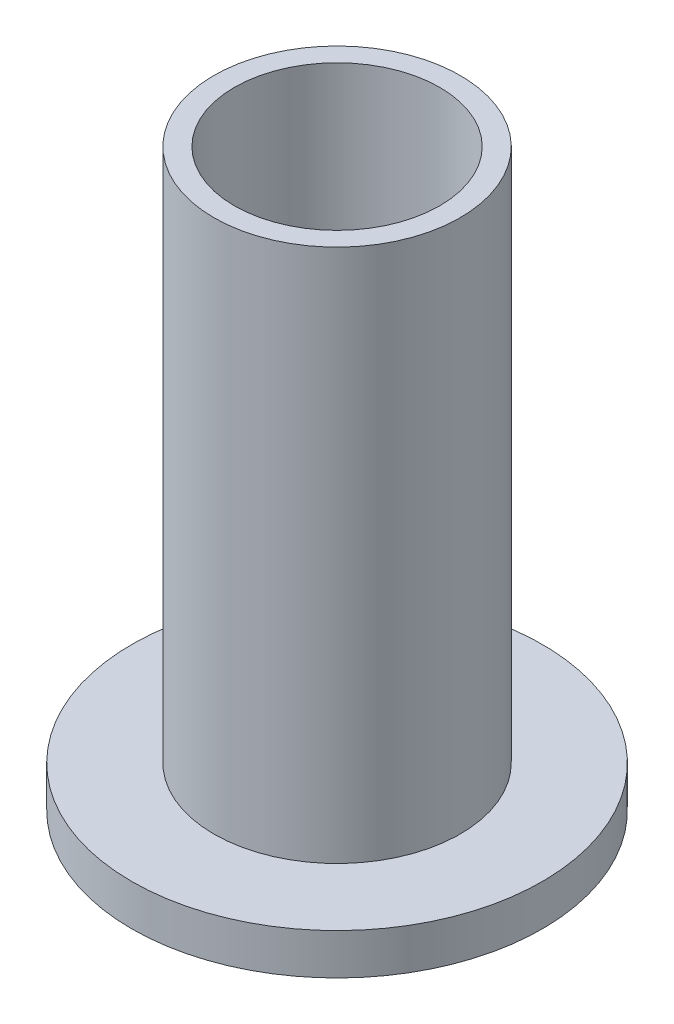
ISO-10303-21;
HEADER;
FILE_DESCRIPTION(('STEP AP214'),'2;1');
FILE_NAME('part.step','',(''),(''),'','','');
FILE_SCHEMA(('AUTOMOTIVE_DESIGN { 1 0 10303 214 1 1 1 1 }'));
ENDSEC;
DATA;
#1=APPLICATION_CONTEXT('core data for automotive mechanical design processes');
#2=APPLICATION_PROTOCOL_DEFINITION('international standard','automotive_design',2000,#1);
#3=PRODUCT_CONTEXT('',#1,'mechanical');
#4=PRODUCT('Part','Part','',(#3));
#5=PRODUCT_RELATED_PRODUCT_CATEGORY('part','',(#4));
#6=PRODUCT_DEFINITION_FORMATION('','',#4);
#7=PRODUCT_DEFINITION_CONTEXT('part definition',#1,'design');
#8=PRODUCT_DEFINITION('design','',#6,#7);
#9=PRODUCT_DEFINITION_SHAPE('','',#8);
#10=(LENGTH_UNIT() NAMED_UNIT(*) SI_UNIT(.MILLI.,.METRE.));
#11=(NAMED_UNIT(*) PLANE_ANGLE_UNIT() SI_UNIT($,.RADIAN.));
#12=(NAMED_UNIT(*) SI_UNIT($,.STERADIAN.) SOLID_ANGLE_UNIT());
#13=UNCERTAINTY_MEASURE_WITH_UNIT(LENGTH_MEASURE(1.E-05),#10,'distance_accuracy_value','');
#14=(GEOMETRIC_REPRESENTATION_CONTEXT(3) GLOBAL_UNCERTAINTY_ASSIGNED_CONTEXT((#13)) GLOBAL_UNIT_ASSIGNED_CONTEXT((#10,
#11,#12)) REPRESENTATION_CONTEXT('',''));
#15=CARTESIAN_POINT('',(0.,0.,0.));
#16=DIRECTION('',(0.,0.,1.));
#17=DIRECTION('',(1.,0.,0.));
#18=AXIS2_PLACEMENT_3D('',#15,#16,#17);
#19=CARTESIAN_POINT('',(-6.,17.1455696202532,0.));
#20=DIRECTION('',(0.,1.,0.));
#21=DIRECTION('',(0.,0.,1.));
#22=AXIS2_PLACEMENT_3D('',#19,#20,#21);
#23=PLANE('',#22);
#24=CARTESIAN_POINT('',(0.,17.1455696202532,0.));
#25=DIRECTION('',(0.,1.,0.));
#26=DIRECTION('',(0.,0.,1.));
#27=AXIS2_PLACEMENT_3D('',#24,#25,#26);
#28=CIRCLE('',#27,6.);
#29=CARTESIAN_POINT('',(0.,17.1455696202532,6.));
#30=VERTEX_POINT('',#29);
#31=EDGE_CURVE('E52',#30,#30,#28,.T.);
#32=ORIENTED_EDGE('',*,*,#31,.T.);
#33=EDGE_LOOP('',(#32));
#34=FACE_BOUND('',#33,.T.);
#35=CARTESIAN_POINT('',(0.,17.1455696202532,0.));
#36=DIRECTION('',(0.,1.,0.));
#37=DIRECTION('',(0.,0.,1.));
#38=AXIS2_PLACEMENT_3D('',#35,#36,#37);
#39=CIRCLE('',#38,5.);
#40=CARTESIAN_POINT('',(0.,17.1455696202532,5.));
#41=VERTEX_POINT('',#40);
#42=EDGE_CURVE('E10',#41,#41,#39,.T.);
#43=ORIENTED_EDGE('',*,*,#42,.F.);
#44=EDGE_LOOP('',(#43));
#45=FACE_BOUND('',#44,.T.);
#46=ADVANCED_FACE('F30',(#34,#45),#23,.T.);
#47=CARTESIAN_POINT('',(0.,15.2848101265823,0.));
#48=DIRECTION('',(0.,1.,0.));
#49=DIRECTION('',(0.,0.,1.));
#50=AXIS2_PLACEMENT_3D('',#47,#48,#49);
#51=CYLINDRICAL_SURFACE('',#50,5.);
#52=ORIENTED_EDGE('',*,*,#42,.T.);
#53=EDGE_LOOP('',(#52));
#54=FACE_BOUND('',#53,.T.);
#55=CARTESIAN_POINT('',(0.,-10.8544303797468,0.));
#56=DIRECTION('',(0.,1.,0.));
#57=DIRECTION('',(0.,0.,1.));
#58=AXIS2_PLACEMENT_3D('',#55,#56,#57);
#59=CIRCLE('',#58,5.);
#60=CARTESIAN_POINT('',(0.,-10.8544303797468,5.));
#61=VERTEX_POINT('',#60);
#62=EDGE_CURVE('E36',#61,#61,#59,.T.);
#63=ORIENTED_EDGE('',*,*,#62,.F.);
#64=EDGE_LOOP('',(#63));
#65=FACE_BOUND('',#64,.T.);
#66=ADVANCED_FACE('F70',(#54,#65),#51,.F.);
#67=CARTESIAN_POINT('',(-5.,-10.8544303797468,0.));
#68=DIRECTION('',(0.,-1.,0.));
#69=DIRECTION('',(0.,0.,-1.));
#70=AXIS2_PLACEMENT_3D('',#67,#68,#69);
#71=PLANE('',#70);
#72=ORIENTED_EDGE('',*,*,#62,.T.);
#73=EDGE_LOOP('',(#72));
#74=FACE_BOUND('',#73,.T.);
#75=CARTESIAN_POINT('',(0.,-10.8544303797468,0.));
#76=DIRECTION('',(0.,1.,0.));
#77=DIRECTION('',(0.,0.,1.));
#78=AXIS2_PLACEMENT_3D('',#75,#76,#77);
#79=CIRCLE('',#78,10.);
#80=CARTESIAN_POINT('',(0.,-10.8544303797468,10.));
#81=VERTEX_POINT('',#80);
#82=EDGE_CURVE('E40',#81,#81,#79,.T.);
#83=ORIENTED_EDGE('',*,*,#82,.F.);
#84=EDGE_LOOP('',(#83));
#85=FACE_BOUND('',#84,.T.);
#86=ADVANCED_FACE('F74',(#74,#85),#71,.T.);
#87=CARTESIAN_POINT('',(0.,15.2848101265823,0.));
#88=DIRECTION('',(0.,1.,0.));
#89=DIRECTION('',(0.,0.,1.));
#90=AXIS2_PLACEMENT_3D('',#87,#88,#89);
#91=CYLINDRICAL_SURFACE('',#90,10.);
#92=ORIENTED_EDGE('',*,*,#82,.T.);
#93=EDGE_LOOP('',(#92));
#94=FACE_BOUND('',#93,.T.);
#95=CARTESIAN_POINT('',(0.,-8.85443037974684,0.));
#96=DIRECTION('',(0.,1.,0.));
#97=DIRECTION('',(0.,0.,1.));
#98=AXIS2_PLACEMENT_3D('',#95,#96,#97);
#99=CIRCLE('',#98,10.);
#100=CARTESIAN_POINT('',(0.,-8.85443037974684,10.));
#101=VERTEX_POINT('',#100);
#102=EDGE_CURVE('E44',#101,#101,#99,.T.);
#103=ORIENTED_EDGE('',*,*,#102,.F.);
#104=EDGE_LOOP('',(#103));
#105=FACE_BOUND('',#104,.T.);
#106=ADVANCED_FACE('F66',(#94,#105),#91,.T.);
#107=CARTESIAN_POINT('',(-10.,-8.85443037974684,0.));
#108=DIRECTION('',(0.,1.,0.));
#109=DIRECTION('',(0.,0.,1.));
#110=AXIS2_PLACEMENT_3D('',#107,#108,#109);
#111=PLANE('',#110);
#112=ORIENTED_EDGE('',*,*,#102,.T.);
#113=EDGE_LOOP('',(#112));
#114=FACE_BOUND('',#113,.T.);
#115=CARTESIAN_POINT('',(0.,-8.85443037974684,0.));
#116=DIRECTION('',(0.,1.,0.));
#117=DIRECTION('',(0.,0.,1.));
#118=AXIS2_PLACEMENT_3D('',#115,#116,#117);
#119=CIRCLE('',#118,6.);
#120=CARTESIAN_POINT('',(0.,-8.85443037974684,6.));
#121=VERTEX_POINT('',#120);
#122=EDGE_CURVE('E49',#121,#121,#119,.T.);
#123=ORIENTED_EDGE('',*,*,#122,.F.);
#124=EDGE_LOOP('',(#123));
#125=FACE_BOUND('',#124,.T.);
#126=ADVANCED_FACE('F60',(#114,#125),#111,.T.);
#127=CARTESIAN_POINT('',(0.,15.2848101265823,0.));
#128=DIRECTION('',(0.,1.,0.));
#129=DIRECTION('',(0.,0.,1.));
#130=AXIS2_PLACEMENT_3D('',#127,#128,#129);
#131=CYLINDRICAL_SURFACE('',#130,6.);
#132=ORIENTED_EDGE('',*,*,#122,.T.);
#133=EDGE_LOOP('',(#132));
#134=FACE_BOUND('',#133,.T.);
#135=ORIENTED_EDGE('',*,*,#31,.F.);
#136=EDGE_LOOP('',(#135));
#137=FACE_BOUND('',#136,.T.);
#138=ADVANCED_FACE('F58',(#134,#137),#131,.T.);
#139=CLOSED_SHELL('',(#46,#66,#86,#106,#126,#138));
#140=MANIFOLD_SOLID_BREP('B2',#139);
#141=ADVANCED_BREP_SHAPE_REPRESENTATION('',(#18,#140),#14);
#142=SHAPE_DEFINITION_REPRESENTATION(#9,#141);
ENDSEC;
END-ISO-10303-21;
